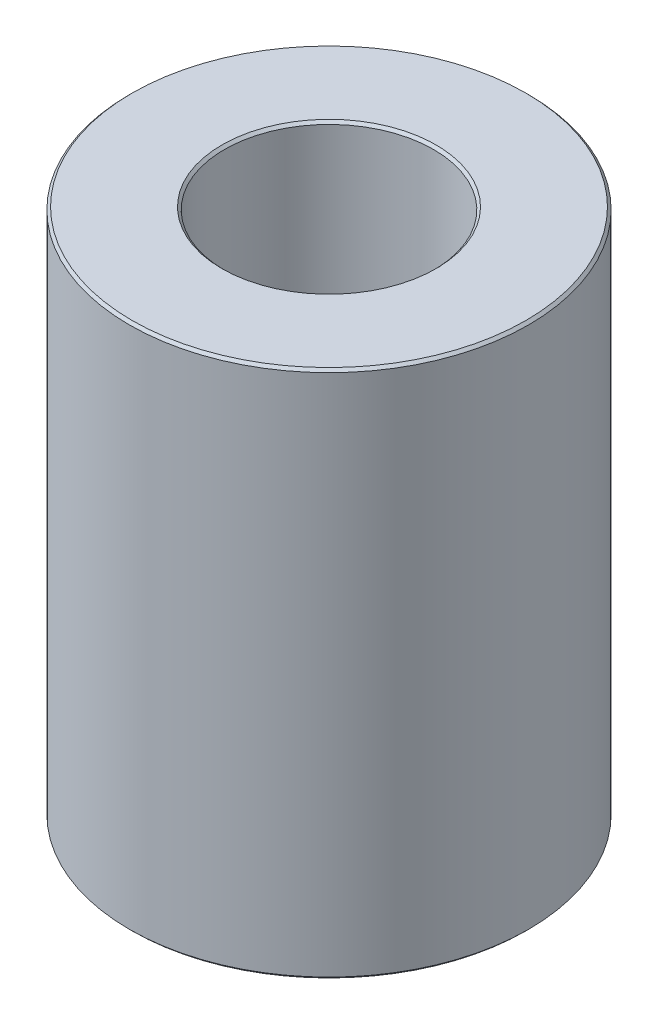
ISO-10303-21;
HEADER;
FILE_DESCRIPTION(('STEP AP214'),'2;1');
FILE_NAME('part.step','',(''),(''),'','','');
FILE_SCHEMA(('AUTOMOTIVE_DESIGN { 1 0 10303 214 1 1 1 1 }'));
ENDSEC;
DATA;
#1=APPLICATION_CONTEXT('core data for automotive mechanical design processes');
#2=APPLICATION_PROTOCOL_DEFINITION('international standard','automotive_design',2000,#1);
#3=PRODUCT_CONTEXT('',#1,'mechanical');
#4=PRODUCT('Part','Part','',(#3));
#5=PRODUCT_RELATED_PRODUCT_CATEGORY('part','',(#4));
#6=PRODUCT_DEFINITION_FORMATION('','',#4);
#7=PRODUCT_DEFINITION_CONTEXT('part definition',#1,'design');
#8=PRODUCT_DEFINITION('design','',#6,#7);
#9=PRODUCT_DEFINITION_SHAPE('','',#8);
#10=(LENGTH_UNIT() NAMED_UNIT(*) SI_UNIT(.MILLI.,.METRE.));
#11=(NAMED_UNIT(*) PLANE_ANGLE_UNIT() SI_UNIT($,.RADIAN.));
#12=(NAMED_UNIT(*) SI_UNIT($,.STERADIAN.) SOLID_ANGLE_UNIT());
#13=UNCERTAINTY_MEASURE_WITH_UNIT(LENGTH_MEASURE(1.E-05),#10,'distance_accuracy_value','');
#14=(GEOMETRIC_REPRESENTATION_CONTEXT(3) GLOBAL_UNCERTAINTY_ASSIGNED_CONTEXT((#13)) GLOBAL_UNIT_ASSIGNED_CONTEXT((#10,
#11,#12)) REPRESENTATION_CONTEXT('',''));
#15=CARTESIAN_POINT('',(0.,0.,0.));
#16=DIRECTION('',(0.,0.,1.));
#17=DIRECTION('',(1.,0.,0.));
#18=AXIS2_PLACEMENT_3D('',#15,#16,#17);
#19=CARTESIAN_POINT('',(0.,158.984296111516,0.));
#20=DIRECTION('',(0.,-1.,0.));
#21=DIRECTION('',(0.,0.,-1.));
#22=AXIS2_PLACEMENT_3D('',#19,#20,#21);
#23=CYLINDRICAL_SURFACE('',#22,60.);
#24=CARTESIAN_POINT('',(0.,0.781539689500205,0.));
#25=DIRECTION('',(0.,1.,0.));
#26=DIRECTION('',(0.,0.,1.));
#27=AXIS2_PLACEMENT_3D('',#24,#25,#26);
#28=CIRCLE('',#27,60.);
#29=CARTESIAN_POINT('',(0.,0.781539689500205,-60.));
#30=VERTEX_POINT('',#29);
#31=EDGE_CURVE('E10',#30,#30,#28,.T.);
#32=CARTESIAN_POINT('',(0.,158.202756422016,0.));
#33=DIRECTION('',(0.,1.,0.));
#34=DIRECTION('',(0.,0.,1.));
#35=AXIS2_PLACEMENT_3D('',#32,#33,#34);
#36=CIRCLE('',#35,60.);
#37=CARTESIAN_POINT('',(0.,158.202756422016,-60.));
#38=VERTEX_POINT('',#37);
#39=EDGE_CURVE('E50',#38,#38,#36,.F.);
#40=CARTESIAN_POINT('',(0.,0.781539689500205,-60.));
#41=CARTESIAN_POINT('',(0.,2.42134403046391,-60.));
#42=CARTESIAN_POINT('',(0.,4.06114837142762,-60.));
#43=CARTESIAN_POINT('',(0.,7.34075705335503,-60.));
#44=CARTESIAN_POINT('',(0.,8.98056139431873,-60.));
#45=CARTESIAN_POINT('',(0.,12.2601700762462,-60.));
#46=CARTESIAN_POINT('',(0.,13.8999744172099,-60.));
#47=CARTESIAN_POINT('',(0.,17.1795830991373,-60.));
#48=CARTESIAN_POINT('',(0.,18.819387440101,-60.));
#49=CARTESIAN_POINT('',(0.,22.0989961220284,-60.));
#50=CARTESIAN_POINT('',(0.,23.7388004629921,-60.));
#51=CARTESIAN_POINT('',(0.,27.0184091449195,-60.));
#52=CARTESIAN_POINT('',(0.,28.6582134858832,-60.));
#53=CARTESIAN_POINT('',(0.,31.9378221678106,-60.));
#54=CARTESIAN_POINT('',(0.,33.5776265087744,-60.));
#55=CARTESIAN_POINT('',(0.,36.8572351907018,-60.));
#56=CARTESIAN_POINT('',(0.,38.4970395316655,-60.));
#57=CARTESIAN_POINT('',(0.,41.7766482135929,-60.));
#58=CARTESIAN_POINT('',(0.,43.4164525545566,-60.));
#59=CARTESIAN_POINT('',(0.,46.696061236484,-60.));
#60=CARTESIAN_POINT('',(0.,48.3358655774477,-60.));
#61=CARTESIAN_POINT('',(0.,51.6154742593751,-60.));
#62=CARTESIAN_POINT('',(0.,53.2552786003388,-60.));
#63=CARTESIAN_POINT('',(0.,56.5348872822663,-60.));
#64=CARTESIAN_POINT('',(0.,58.17469162323,-60.));
#65=CARTESIAN_POINT('',(0.,61.4543003051574,-60.));
#66=CARTESIAN_POINT('',(0.,63.0941046461211,-60.));
#67=CARTESIAN_POINT('',(0.,66.3737133280485,-60.));
#68=CARTESIAN_POINT('',(0.,68.0135176690122,-60.));
#69=CARTESIAN_POINT('',(0.,71.2931263509396,-60.));
#70=CARTESIAN_POINT('',(0.,72.9329306919033,-60.));
#71=CARTESIAN_POINT('',(0.,76.2125393738308,-60.));
#72=CARTESIAN_POINT('',(0.,77.8523437147944,-60.));
#73=CARTESIAN_POINT('',(0.,81.1319523967219,-60.));
#74=CARTESIAN_POINT('',(0.,82.7717567376856,-60.));
#75=CARTESIAN_POINT('',(0.,86.051365419613,-60.));
#76=CARTESIAN_POINT('',(0.,87.6911697605767,-60.));
#77=CARTESIAN_POINT('',(0.,90.9707784425041,-60.));
#78=CARTESIAN_POINT('',(0.,92.6105827834678,-60.));
#79=CARTESIAN_POINT('',(0.,95.8901914653952,-60.));
#80=CARTESIAN_POINT('',(0.,97.5299958063589,-60.));
#81=CARTESIAN_POINT('',(0.,100.809604488286,-60.));
#82=CARTESIAN_POINT('',(0.,102.44940882925,-60.));
#83=CARTESIAN_POINT('',(0.,105.729017511177,-60.));
#84=CARTESIAN_POINT('',(0.,107.368821852141,-60.));
#85=CARTESIAN_POINT('',(0.,110.648430534069,-60.));
#86=CARTESIAN_POINT('',(0.,112.288234875032,-60.));
#87=CARTESIAN_POINT('',(0.,115.56784355696,-60.));
#88=CARTESIAN_POINT('',(0.,117.207647897923,-60.));
#89=CARTESIAN_POINT('',(0.,120.487256579851,-60.));
#90=CARTESIAN_POINT('',(0.,122.127060920815,-60.));
#91=CARTESIAN_POINT('',(0.,125.406669602742,-60.));
#92=CARTESIAN_POINT('',(0.,127.046473943706,-60.));
#93=CARTESIAN_POINT('',(0.,130.326082625633,-60.));
#94=CARTESIAN_POINT('',(0.,131.965886966597,-60.));
#95=CARTESIAN_POINT('',(0.,135.245495648524,-60.));
#96=CARTESIAN_POINT('',(0.,136.885299989488,-60.));
#97=CARTESIAN_POINT('',(0.,140.164908671415,-60.));
#98=CARTESIAN_POINT('',(0.,141.804713012379,-60.));
#99=CARTESIAN_POINT('',(0.,145.084321694306,-60.));
#100=CARTESIAN_POINT('',(0.,146.72412603527,-60.));
#101=CARTESIAN_POINT('',(0.,150.003734717198,-60.));
#102=CARTESIAN_POINT('',(0.,151.643539058161,-60.));
#103=CARTESIAN_POINT('',(0.,154.923147740089,-60.));
#104=CARTESIAN_POINT('',(0.,156.562952081052,-60.));
#105=CARTESIAN_POINT('',(0.,158.202756422016,-60.));
#106=B_SPLINE_CURVE_WITH_KNOTS('',3,(#40,#41,#42,#43,#44,#45,#46,#47,#48,#49,#50,#51,#52,#53,
#54,#55,#56,#57,#58,#59,#60,#61,#62,#63,#64,#65,#66,#67,#68,#69,#70,#71,#72,#73,#74,#75,#76,#77,
#78,#79,#80,#81,#82,#83,#84,#85,#86,#87,#88,#89,#90,#91,#92,#93,#94,#95,#96,#97,#98,#99,#100,
#101,#102,#103,#104,#105),.UNSPECIFIED.,.F.,.F.,(4,2,2,2,2,2,2,2,2,2,2,2,2,2,2,2,2,2,2,2,2,2,2,
2,2,2,2,2,2,2,2,2,4),(0.,4.91941302289112,9.83882604578223,14.7582390686734,19.6776520915645,
24.5970651144556,29.5164781373467,34.4358911602378,39.355304183129,44.2747172060201,
49.1941302289112,54.1135432518023,59.0329562746935,63.9523692975846,68.8717823204757,
73.7911953433668,78.710608366258,83.6300213891491,88.5494344120402,93.4688474349313,
98.3882604578225,103.307673480714,108.227086503605,113.146499526496,118.065912549387,
122.985325572278,127.904738595169,132.82415161806,137.743564640951,142.662977663843,
147.582390686734,152.501803709625,157.421216732516),.UNSPECIFIED.);
#107=EDGE_CURVE('BSEAM39',#30,#38,#106,.T.);
#108=ORIENTED_EDGE('',*,*,#31,.T.);
#109=ORIENTED_EDGE('',*,*,#39,.T.);
#110=ORIENTED_EDGE('',*,*,#107,.T.);
#111=ORIENTED_EDGE('',*,*,#107,.F.);
#112=EDGE_LOOP('',(#108,#110,#109,#111));
#113=FACE_BOUND('',#112,.T.);
#114=ADVANCED_FACE('F39',(#113),#23,.T.);
#115=CARTESIAN_POINT('',(0.,158.984296111516,0.));
#116=DIRECTION('',(0.,1.,0.));
#117=DIRECTION('',(0.,0.,1.));
#118=AXIS2_PLACEMENT_3D('',#115,#116,#117);
#119=PLANE('',#118);
#120=CARTESIAN_POINT('',(0.,158.984296111516,0.));
#121=DIRECTION('',(0.,1.,0.));
#122=DIRECTION('',(0.,0.,1.));
#123=AXIS2_PLACEMENT_3D('',#120,#121,#122);
#124=CIRCLE('',#123,32.2207163787422);
#125=CARTESIAN_POINT('',(0.,158.984296111516,32.2207163787421));
#126=VERTEX_POINT('',#125);
#127=EDGE_CURVE('E58',#126,#126,#124,.F.);
#128=ORIENTED_EDGE('',*,*,#127,.T.);
#129=EDGE_LOOP('',(#128));
#130=FACE_BOUND('',#129,.T.);
#131=CARTESIAN_POINT('',(0.,158.984296111516,0.));
#132=DIRECTION('',(0.,1.,0.));
#133=DIRECTION('',(0.,0.,1.));
#134=AXIS2_PLACEMENT_3D('',#131,#132,#133);
#135=CIRCLE('',#134,59.2184603104998);
#136=CARTESIAN_POINT('',(0.,158.984296111516,-59.2184603104998));
#137=VERTEX_POINT('',#136);
#138=EDGE_CURVE('E61',#137,#137,#135,.T.);
#139=ORIENTED_EDGE('',*,*,#138,.T.);
#140=EDGE_LOOP('',(#139));
#141=FACE_BOUND('',#140,.T.);
#142=ADVANCED_FACE('F88',(#130,#141),#119,.T.);
#143=CARTESIAN_POINT('',(0.,0.,0.));
#144=DIRECTION('',(0.,1.,0.));
#145=DIRECTION('',(0.,0.,1.));
#146=AXIS2_PLACEMENT_3D('',#143,#144,#145);
#147=PLANE('',#146);
#148=CARTESIAN_POINT('',(0.,0.,0.));
#149=DIRECTION('',(0.,1.,0.));
#150=DIRECTION('',(0.,0.,1.));
#151=AXIS2_PLACEMENT_3D('',#148,#149,#150);
#152=CIRCLE('',#151,32.2207163787421);
#153=CARTESIAN_POINT('',(0.,0.,32.2207163787421));
#154=VERTEX_POINT('',#153);
#155=EDGE_CURVE('E51',#154,#154,#152,.T.);
#156=ORIENTED_EDGE('',*,*,#155,.T.);
#157=EDGE_LOOP('',(#156));
#158=FACE_BOUND('',#157,.T.);
#159=CARTESIAN_POINT('',(0.,0.,0.));
#160=DIRECTION('',(0.,1.,0.));
#161=DIRECTION('',(0.,0.,1.));
#162=AXIS2_PLACEMENT_3D('',#159,#160,#161);
#163=CIRCLE('',#162,59.2184603104998);
#164=CARTESIAN_POINT('',(0.,0.,59.2184603104998));
#165=VERTEX_POINT('',#164);
#166=EDGE_CURVE('E54',#165,#165,#163,.F.);
#167=ORIENTED_EDGE('',*,*,#166,.T.);
#168=EDGE_LOOP('',(#167));
#169=FACE_BOUND('',#168,.T.);
#170=ADVANCED_FACE('F83',(#158,#169),#147,.F.);
#171=CARTESIAN_POINT('',(0.,158.984296111516,0.));
#172=DIRECTION('',(0.,-1.,0.));
#173=DIRECTION('',(0.,0.,-1.));
#174=AXIS2_PLACEMENT_3D('',#171,#172,#173);
#175=CYLINDRICAL_SURFACE('',#174,31.439176689242);
#176=CARTESIAN_POINT('',(0.,158.202756422016,0.));
#177=DIRECTION('',(0.,1.,0.));
#178=DIRECTION('',(0.,0.,1.));
#179=AXIS2_PLACEMENT_3D('',#176,#177,#178);
#180=CIRCLE('',#179,31.439176689242);
#181=CARTESIAN_POINT('',(0.,158.202756422016,31.4391766892419));
#182=VERTEX_POINT('',#181);
#183=EDGE_CURVE('E67',#182,#182,#180,.T.);
#184=ORIENTED_EDGE('',*,*,#183,.T.);
#185=EDGE_LOOP('',(#184));
#186=FACE_BOUND('',#185,.T.);
#187=CARTESIAN_POINT('',(0.,0.781539689500177,0.));
#188=DIRECTION('',(0.,1.,0.));
#189=DIRECTION('',(0.,0.,1.));
#190=AXIS2_PLACEMENT_3D('',#187,#188,#189);
#191=CIRCLE('',#190,31.439176689242);
#192=CARTESIAN_POINT('',(0.,0.781539689500177,31.439176689242));
#193=VERTEX_POINT('',#192);
#194=EDGE_CURVE('E69',#193,#193,#191,.F.);
#195=ORIENTED_EDGE('',*,*,#194,.T.);
#196=EDGE_LOOP('',(#195));
#197=FACE_BOUND('',#196,.T.);
#198=ADVANCED_FACE('F71',(#186,#197),#175,.F.);
#199=CARTESIAN_POINT('',(0.,158.202756422016,0.));
#200=DIRECTION('',(0.,1.,0.));
#201=DIRECTION('',(0.,0.,1.));
#202=AXIS2_PLACEMENT_3D('',#199,#200,#201);
#203=CONICAL_SURFACE('',#202,31.439176689242,0.785398163397444);
#204=CARTESIAN_POINT('',(0.,158.984296111516,32.2207163787421));
#205=CARTESIAN_POINT('',(0.,158.976155073084,32.2125753403099));
#206=CARTESIAN_POINT('',(0.,158.968014034652,32.2044343018776));
#207=CARTESIAN_POINT('',(0.,158.951731957787,32.188152225013));
#208=CARTESIAN_POINT('',(0.,158.943590919355,32.1800111865807));
#209=CARTESIAN_POINT('',(0.,158.92730884249,32.1637291097161));
#210=CARTESIAN_POINT('',(0.,158.919167804058,32.1555880712838));
#211=CARTESIAN_POINT('',(0.,158.902885727193,32.1393059944192));
#212=CARTESIAN_POINT('',(0.,158.894744688761,32.1311649559869));
#213=CARTESIAN_POINT('',(0.,158.878462611897,32.1148828791223));
#214=CARTESIAN_POINT('',(0.,158.870321573464,32.10674184069));
#215=CARTESIAN_POINT('',(0.,158.8540394966,32.0904597638254));
#216=CARTESIAN_POINT('',(0.,158.845898458167,32.0823187253932));
#217=CARTESIAN_POINT('',(0.,158.829616381303,32.0660366485286));
#218=CARTESIAN_POINT('',(0.,158.82147534287,32.0578956100963));
#219=CARTESIAN_POINT('',(0.,158.805193266006,32.0416135332317));
#220=CARTESIAN_POINT('',(0.,158.797052227574,32.0334724947994));
#221=CARTESIAN_POINT('',(0.,158.780770150709,32.0171904179348));
#222=CARTESIAN_POINT('',(0.,158.772629112277,32.0090493795025));
#223=CARTESIAN_POINT('',(0.,158.756347035412,31.9927673026379));
#224=CARTESIAN_POINT('',(0.,158.74820599698,31.9846262642056));
#225=CARTESIAN_POINT('',(0.,158.731923920115,31.968344187341));
#226=CARTESIAN_POINT('',(0.,158.723782881683,31.9602031489087));
#227=CARTESIAN_POINT('',(0.,158.707500804818,31.9439210720442));
#228=CARTESIAN_POINT('',(0.,158.699359766386,31.9357800336119));
#229=CARTESIAN_POINT('',(0.,158.683077689521,31.9194979567473));
#230=CARTESIAN_POINT('',(0.,158.674936651089,31.911356918315));
#231=CARTESIAN_POINT('',(0.,158.658654574225,31.8950748414504));
#232=CARTESIAN_POINT('',(0.,158.650513535792,31.8869338030181));
#233=CARTESIAN_POINT('',(0.,158.634231458928,31.8706517261535));
#234=CARTESIAN_POINT('',(0.,158.626090420495,31.8625106877212));
#235=CARTESIAN_POINT('',(0.,158.609808343631,31.8462286108566));
#236=CARTESIAN_POINT('',(0.,158.601667305199,31.8380875724243));
#237=CARTESIAN_POINT('',(0.,158.585385228334,31.8218054955598));
#238=CARTESIAN_POINT('',(0.,158.577244189902,31.8136644571275));
#239=CARTESIAN_POINT('',(0.,158.560962113037,31.7973823802629));
#240=CARTESIAN_POINT('',(0.,158.552821074605,31.7892413418306));
#241=CARTESIAN_POINT('',(0.,158.53653899774,31.772959264966));
#242=CARTESIAN_POINT('',(0.,158.528397959308,31.7648182265337));
#243=CARTESIAN_POINT('',(0.,158.512115882443,31.7485361496691));
#244=CARTESIAN_POINT('',(0.,158.503974844011,31.7403951112368));
#245=CARTESIAN_POINT('',(0.,158.487692767146,31.7241130343722));
#246=CARTESIAN_POINT('',(0.,158.479551728714,31.7159719959399));
#247=CARTESIAN_POINT('',(0.,158.46326965185,31.6996899190753));
#248=CARTESIAN_POINT('',(0.,158.455128613417,31.6915488806431));
#249=CARTESIAN_POINT('',(0.,158.438846536553,31.6752668037785));
#250=CARTESIAN_POINT('',(0.,158.43070549812,31.6671257653462));
#251=CARTESIAN_POINT('',(0.,158.414423421256,31.6508436884816));
#252=CARTESIAN_POINT('',(0.,158.406282382823,31.6427026500493));
#253=CARTESIAN_POINT('',(0.,158.390000305959,31.6264205731847));
#254=CARTESIAN_POINT('',(0.,158.381859267527,31.6182795347524));
#255=CARTESIAN_POINT('',(0.,158.365577190662,31.6019974578878));
#256=CARTESIAN_POINT('',(0.,158.35743615223,31.5938564194555));
#257=CARTESIAN_POINT('',(0.,158.341154075365,31.5775743425909));
#258=CARTESIAN_POINT('',(0.,158.333013036933,31.5694333041587));
#259=CARTESIAN_POINT('',(0.,158.316730960068,31.5531512272941));
#260=CARTESIAN_POINT('',(0.,158.308589921636,31.5450101888618));
#261=CARTESIAN_POINT('',(0.,158.292307844771,31.5287281119972));
#262=CARTESIAN_POINT('',(0.,158.284166806339,31.5205870735649));
#263=CARTESIAN_POINT('',(0.,158.267884729474,31.5043049967003));
#264=CARTESIAN_POINT('',(0.,158.259743691042,31.496163958268));
#265=CARTESIAN_POINT('',(0.,158.243461614178,31.4798818814034));
#266=CARTESIAN_POINT('',(0.,158.235320575745,31.4717408429711));
#267=CARTESIAN_POINT('',(0.,158.219038498881,31.4554587661065));
#268=CARTESIAN_POINT('',(0.,158.210897460448,31.4473177276742));
#269=CARTESIAN_POINT('',(0.,158.202756422016,31.4391766892419));
#270=B_SPLINE_CURVE_WITH_KNOTS('',3,(#204,#205,#206,#207,#208,#209,#210,#211,#212,#213,#214,
#215,#216,#217,#218,#219,#220,#221,#222,#223,#224,#225,#226,#227,#228,#229,#230,#231,#232,#233,
#234,#235,#236,#237,#238,#239,#240,#241,#242,#243,#244,#245,#246,#247,#248,#249,#250,#251,#252,
#253,#254,#255,#256,#257,#258,#259,#260,#261,#262,#263,#264,#265,#266,#267,#268,#269),
.UNSPECIFIED.,.F.,.F.,(4,2,2,2,2,2,2,2,2,2,2,2,2,2,2,2,2,2,2,2,2,2,2,2,2,2,2,2,2,2,2,2,4),(0.,
0.0345395008882674,0.0690790017765201,0.103618502664768,0.138158003553016,0.172697504441268,
0.207237005329516,0.241776506217764,0.276316007106017,0.310855507994265,0.345395008882512,
0.379934509770785,0.414474010659032,0.44901351154728,0.483553012435533,0.518092513323781,
0.552632014212028,0.587171515100281,0.621711015988529,0.656250516876782,0.690790017765029,
0.725329518653277,0.75986901954155,0.794408520429797,0.828948021318045,0.863487522206298,
0.898027023094546,0.932566523982793,0.967106024871046,1.00164552575929,1.03618502664754,
1.07072452753579,1.10526402842404),.UNSPECIFIED.);
#271=EDGE_CURVE('BSEAM77',#126,#182,#270,.T.);
#272=ORIENTED_EDGE('',*,*,#127,.F.);
#273=ORIENTED_EDGE('',*,*,#183,.F.);
#274=ORIENTED_EDGE('',*,*,#271,.T.);
#275=ORIENTED_EDGE('',*,*,#271,.F.);
#276=EDGE_LOOP('',(#272,#274,#273,#275));
#277=FACE_BOUND('',#276,.T.);
#278=ADVANCED_FACE('F77',(#277),#203,.F.);
#279=CARTESIAN_POINT('',(0.,0.,0.));
#280=DIRECTION('',(0.,-1.,0.));
#281=DIRECTION('',(0.,0.,-1.));
#282=AXIS2_PLACEMENT_3D('',#279,#280,#281);
#283=CONICAL_SURFACE('',#282,32.2207163787421,0.785398163397444);
#284=ORIENTED_EDGE('',*,*,#194,.F.);
#285=EDGE_LOOP('',(#284));
#286=FACE_BOUND('',#285,.T.);
#287=ORIENTED_EDGE('',*,*,#155,.F.);
#288=EDGE_LOOP('',(#287));
#289=FACE_BOUND('',#288,.T.);
#290=ADVANCED_FACE('F73',(#286,#289),#283,.F.);
#291=CARTESIAN_POINT('',(0.,0.781539689500205,0.));
#292=DIRECTION('',(0.,1.,0.));
#293=DIRECTION('',(0.,0.,1.));
#294=AXIS2_PLACEMENT_3D('',#291,#292,#293);
#295=CONICAL_SURFACE('',#294,60.,0.785398163397448);
#296=ORIENTED_EDGE('',*,*,#166,.F.);
#297=EDGE_LOOP('',(#296));
#298=FACE_BOUND('',#297,.T.);
#299=ORIENTED_EDGE('',*,*,#31,.F.);
#300=EDGE_LOOP('',(#299));
#301=FACE_BOUND('',#300,.T.);
#302=ADVANCED_FACE('F76',(#298,#301),#295,.T.);
#303=CARTESIAN_POINT('',(0.,158.984296111516,0.));
#304=DIRECTION('',(0.,-1.,0.));
#305=DIRECTION('',(0.,0.,-1.));
#306=AXIS2_PLACEMENT_3D('',#303,#304,#305);
#307=CONICAL_SURFACE('',#306,59.2184603104998,0.785398163397448);
#308=CARTESIAN_POINT('',(0.,158.202756422016,-60.));
#309=CARTESIAN_POINT('',(0.,158.210897460448,-59.9918589615677));
#310=CARTESIAN_POINT('',(0.,158.219038498881,-59.9837179231354));
#311=CARTESIAN_POINT('',(0.,158.235320575745,-59.9674358462708));
#312=CARTESIAN_POINT('',(0.,158.243461614178,-59.9592948078385));
#313=CARTESIAN_POINT('',(0.,158.259743691042,-59.943012730974));
#314=CARTESIAN_POINT('',(0.,158.267884729474,-59.9348716925417));
#315=CARTESIAN_POINT('',(0.,158.284166806339,-59.9185896156771));
#316=CARTESIAN_POINT('',(0.,158.292307844771,-59.9104485772448));
#317=CARTESIAN_POINT('',(0.,158.308589921636,-59.8941665003802));
#318=CARTESIAN_POINT('',(0.,158.316730960068,-59.8860254619479));
#319=CARTESIAN_POINT('',(0.,158.333013036933,-59.8697433850833));
#320=CARTESIAN_POINT('',(0.,158.341154075365,-59.861602346651));
#321=CARTESIAN_POINT('',(0.,158.35743615223,-59.8453202697864));
#322=CARTESIAN_POINT('',(0.,158.365577190662,-59.8371792313541));
#323=CARTESIAN_POINT('',(0.,158.381859267527,-59.8208971544895));
#324=CARTESIAN_POINT('',(0.,158.390000305959,-59.8127561160573));
#325=CARTESIAN_POINT('',(0.,158.406282382823,-59.7964740391927));
#326=CARTESIAN_POINT('',(0.,158.414423421256,-59.7883330007604));
#327=CARTESIAN_POINT('',(0.,158.43070549812,-59.7720509238958));
#328=CARTESIAN_POINT('',(0.,158.438846536553,-59.7639098854635));
#329=CARTESIAN_POINT('',(0.,158.455128613417,-59.7476278085989));
#330=CARTESIAN_POINT('',(0.,158.46326965185,-59.7394867701666));
#331=CARTESIAN_POINT('',(0.,158.479551728714,-59.723204693302));
#332=CARTESIAN_POINT('',(0.,158.487692767146,-59.7150636548697));
#333=CARTESIAN_POINT('',(0.,158.503974844011,-59.6987815780051));
#334=CARTESIAN_POINT('',(0.,158.512115882443,-59.6906405395728));
#335=CARTESIAN_POINT('',(0.,158.528397959308,-59.6743584627082));
#336=CARTESIAN_POINT('',(0.,158.53653899774,-59.666217424276));
#337=CARTESIAN_POINT('',(0.,158.552821074605,-59.6499353474114));
#338=CARTESIAN_POINT('',(0.,158.560962113037,-59.6417943089791));
#339=CARTESIAN_POINT('',(0.,158.577244189902,-59.6255122321145));
#340=CARTESIAN_POINT('',(0.,158.585385228334,-59.6173711936822));
#341=CARTESIAN_POINT('',(0.,158.601667305199,-59.6010891168176));
#342=CARTESIAN_POINT('',(0.,158.609808343631,-59.5929480783853));
#343=CARTESIAN_POINT('',(0.,158.626090420495,-59.5766660015207));
#344=CARTESIAN_POINT('',(0.,158.634231458928,-59.5685249630884));
#345=CARTESIAN_POINT('',(0.,158.650513535792,-59.5522428862238));
#346=CARTESIAN_POINT('',(0.,158.658654574225,-59.5441018477915));
#347=CARTESIAN_POINT('',(0.,158.674936651089,-59.527819770927));
#348=CARTESIAN_POINT('',(0.,158.683077689521,-59.5196787324947));
#349=CARTESIAN_POINT('',(0.,158.699359766386,-59.5033966556301));
#350=CARTESIAN_POINT('',(0.,158.707500804818,-59.4952556171978));
#351=CARTESIAN_POINT('',(0.,158.723782881683,-59.4789735403332));
#352=CARTESIAN_POINT('',(0.,158.731923920115,-59.4708325019009));
#353=CARTESIAN_POINT('',(0.,158.74820599698,-59.4545504250363));
#354=CARTESIAN_POINT('',(0.,158.756347035412,-59.446409386604));
#355=CARTESIAN_POINT('',(0.,158.772629112277,-59.4301273097394));
#356=CARTESIAN_POINT('',(0.,158.780770150709,-59.4219862713071));
#357=CARTESIAN_POINT('',(0.,158.797052227574,-59.4057041944425));
#358=CARTESIAN_POINT('',(0.,158.805193266006,-59.3975631560103));
#359=CARTESIAN_POINT('',(0.,158.82147534287,-59.3812810791457));
#360=CARTESIAN_POINT('',(0.,158.829616381303,-59.3731400407134));
#361=CARTESIAN_POINT('',(0.,158.845898458167,-59.3568579638488));
#362=CARTESIAN_POINT('',(0.,158.8540394966,-59.3487169254165));
#363=CARTESIAN_POINT('',(0.,158.870321573464,-59.3324348485519));
#364=CARTESIAN_POINT('',(0.,158.878462611897,-59.3242938101196));
#365=CARTESIAN_POINT('',(0.,158.894744688761,-59.308011733255));
#366=CARTESIAN_POINT('',(0.,158.902885727193,-59.2998706948227));
#367=CARTESIAN_POINT('',(0.,158.919167804058,-59.2835886179581));
#368=CARTESIAN_POINT('',(0.,158.92730884249,-59.2754475795258));
#369=CARTESIAN_POINT('',(0.,158.943590919355,-59.2591655026612));
#370=CARTESIAN_POINT('',(0.,158.951731957787,-59.251024464229));
#371=CARTESIAN_POINT('',(0.,158.968014034652,-59.2347423873644));
#372=CARTESIAN_POINT('',(0.,158.976155073084,-59.2266013489321));
#373=CARTESIAN_POINT('',(0.,158.984296111516,-59.2184603104998));
#374=B_SPLINE_CURVE_WITH_KNOTS('',3,(#308,#309,#310,#311,#312,#313,#314,#315,#316,#317,#318,
#319,#320,#321,#322,#323,#324,#325,#326,#327,#328,#329,#330,#331,#332,#333,#334,#335,#336,#337,
#338,#339,#340,#341,#342,#343,#344,#345,#346,#347,#348,#349,#350,#351,#352,#353,#354,#355,#356,
#357,#358,#359,#360,#361,#362,#363,#364,#365,#366,#367,#368,#369,#370,#371,#372,#373),
.UNSPECIFIED.,.F.,.F.,(4,2,2,2,2,2,2,2,2,2,2,2,2,2,2,2,2,2,2,2,2,2,2,2,2,2,2,2,2,2,2,2,4),(0.,
0.0345395008882478,0.0690790017765005,0.103618502664753,0.138158003553001,0.172697504441249,
0.207237005329501,0.241776506217754,0.276316007106022,0.310855507994269,0.345395008882522,
0.379934509770775,0.414474010659023,0.44901351154727,0.483553012435523,0.518092513323776,
0.552632014212043,0.587171515100291,0.621711015988544,0.656250516876796,0.690790017765044,
0.725329518653292,0.759869019541545,0.794408520429797,0.828948021318065,0.863487522206313,
0.898027023094565,0.932566523982818,0.967106024871066,1.00164552575931,1.03618502664757,
1.07072452753582,1.10526402842409),.UNSPECIFIED.);
#375=EDGE_CURVE('BSEAM45',#38,#137,#374,.T.);
#376=ORIENTED_EDGE('',*,*,#39,.F.);
#377=ORIENTED_EDGE('',*,*,#138,.F.);
#378=ORIENTED_EDGE('',*,*,#375,.T.);
#379=ORIENTED_EDGE('',*,*,#375,.F.);
#380=EDGE_LOOP('',(#376,#378,#377,#379));
#381=FACE_BOUND('',#380,.T.);
#382=ADVANCED_FACE('F45',(#381),#307,.T.);
#383=CLOSED_SHELL('',(#114,#142,#170,#198,#278,#290,#302,#382));
#384=MANIFOLD_SOLID_BREP('B2',#383);
#385=ADVANCED_BREP_SHAPE_REPRESENTATION('',(#18,#384),#14);
#386=SHAPE_DEFINITION_REPRESENTATION(#9,#385);
ENDSEC;
END-ISO-10303-21;
